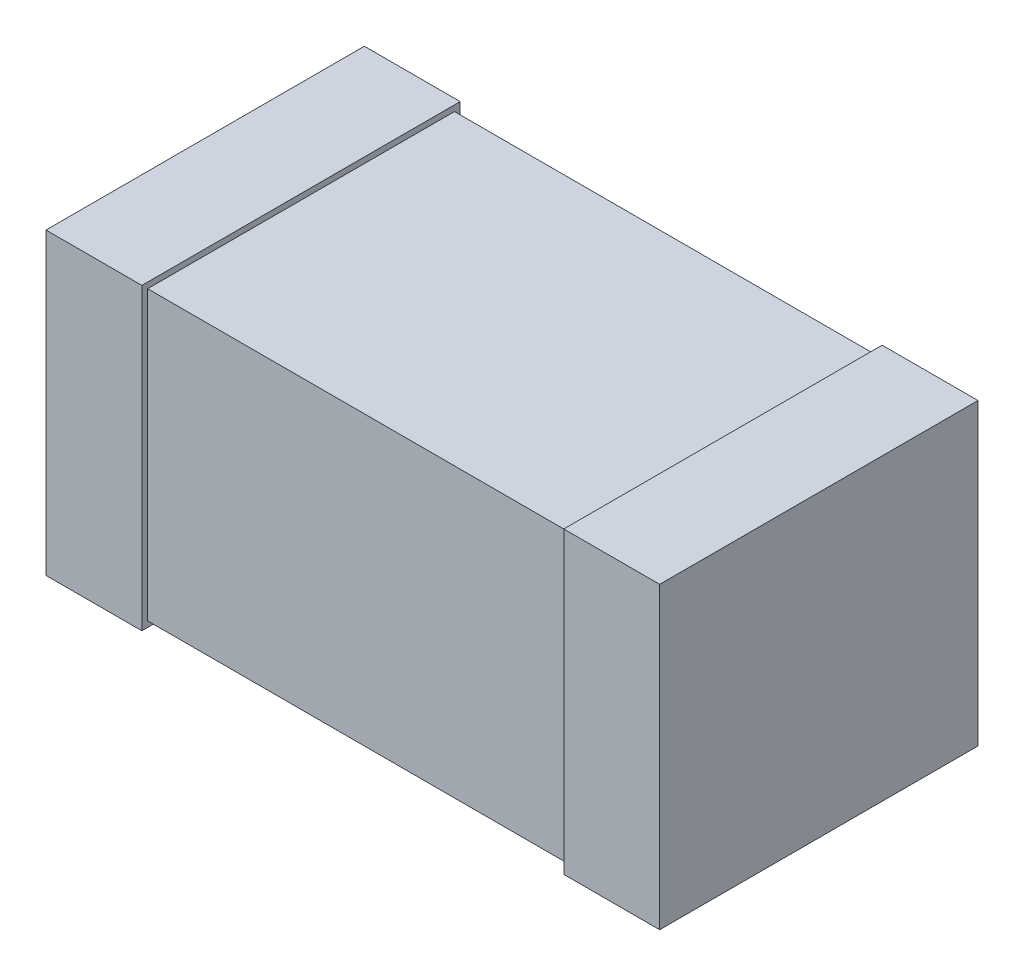
ISO-10303-21;
HEADER;
FILE_DESCRIPTION(('STEP AP214'),'2;1');
FILE_NAME('part.step','',(''),(''),'','','');
FILE_SCHEMA(('AUTOMOTIVE_DESIGN { 1 0 10303 214 1 1 1 1 }'));
ENDSEC;
DATA;
#1=APPLICATION_CONTEXT('core data for automotive mechanical design processes');
#2=APPLICATION_PROTOCOL_DEFINITION('international standard','automotive_design',2000,#1);
#3=PRODUCT_CONTEXT('',#1,'mechanical');
#4=PRODUCT('Part','Part','',(#3));
#5=PRODUCT_RELATED_PRODUCT_CATEGORY('part','',(#4));
#6=PRODUCT_DEFINITION_FORMATION('','',#4);
#7=PRODUCT_DEFINITION_CONTEXT('part definition',#1,'design');
#8=PRODUCT_DEFINITION('design','',#6,#7);
#9=PRODUCT_DEFINITION_SHAPE('','',#8);
#10=(LENGTH_UNIT() NAMED_UNIT(*) SI_UNIT(.MILLI.,.METRE.));
#11=(NAMED_UNIT(*) PLANE_ANGLE_UNIT() SI_UNIT($,.RADIAN.));
#12=(NAMED_UNIT(*) SI_UNIT($,.STERADIAN.) SOLID_ANGLE_UNIT());
#13=UNCERTAINTY_MEASURE_WITH_UNIT(LENGTH_MEASURE(1.E-05),#10,'distance_accuracy_value','');
#14=(GEOMETRIC_REPRESENTATION_CONTEXT(3) GLOBAL_UNCERTAINTY_ASSIGNED_CONTEXT((#13)) GLOBAL_UNIT_ASSIGNED_CONTEXT((#10,
#11,#12)) REPRESENTATION_CONTEXT('',''));
#15=CARTESIAN_POINT('',(0.,0.,0.));
#16=DIRECTION('',(0.,0.,1.));
#17=DIRECTION('',(1.,0.,0.));
#18=AXIS2_PLACEMENT_3D('',#15,#16,#17);
#19=CARTESIAN_POINT('',(-1.6,1.5,0.8));
#20=DIRECTION('',(0.,0.,-1.));
#21=DIRECTION('',(-1.,0.,0.));
#22=AXIS2_PLACEMENT_3D('',#19,#20,#21);
#23=PLANE('',#22);
#24=DIRECTION('',(0.,-1.,0.));
#25=VECTOR('',#24,1.);
#26=CARTESIAN_POINT('',(1.1,1.5,0.8));
#27=LINE('',#26,#25);
#28=CARTESIAN_POINT('',(1.1,1.5,0.8));
#29=VERTEX_POINT('',#28);
#30=CARTESIAN_POINT('',(1.1,0.,0.8));
#31=VERTEX_POINT('',#30);
#32=EDGE_CURVE('E33',#29,#31,#27,.T.);
#33=ORIENTED_EDGE('',*,*,#32,.F.);
#34=DIRECTION('',(1.,0.,0.));
#35=VECTOR('',#34,1.);
#36=CARTESIAN_POINT('',(-1.6,1.5,0.8));
#37=LINE('',#36,#35);
#38=CARTESIAN_POINT('',(-1.1,1.5,0.8));
#39=VERTEX_POINT('',#38);
#40=EDGE_CURVE('E198',#39,#29,#37,.T.);
#41=ORIENTED_EDGE('',*,*,#40,.F.);
#42=DIRECTION('',(0.,1.,0.));
#43=VECTOR('',#42,1.);
#44=CARTESIAN_POINT('',(-1.1,1.5,0.8));
#45=LINE('',#44,#43);
#46=CARTESIAN_POINT('',(-1.1,0.,0.8));
#47=VERTEX_POINT('',#46);
#48=EDGE_CURVE('E192',#47,#39,#45,.T.);
#49=ORIENTED_EDGE('',*,*,#48,.F.);
#50=DIRECTION('',(1.,0.,0.));
#51=VECTOR('',#50,1.);
#52=CARTESIAN_POINT('',(-1.6,0.,0.8));
#53=LINE('',#52,#51);
#54=EDGE_CURVE('E197',#47,#31,#53,.T.);
#55=ORIENTED_EDGE('',*,*,#54,.T.);
#56=EDGE_LOOP('',(#33,#41,#49,#55));
#57=FACE_BOUND('',#56,.T.);
#58=ADVANCED_FACE('F18',(#57),#23,.F.);
#59=CARTESIAN_POINT('',(-1.6,1.5,-0.8));
#60=DIRECTION('',(0.,0.,1.));
#61=DIRECTION('',(1.,0.,0.));
#62=AXIS2_PLACEMENT_3D('',#59,#60,#61);
#63=PLANE('',#62);
#64=DIRECTION('',(0.,1.,0.));
#65=VECTOR('',#64,1.);
#66=CARTESIAN_POINT('',(1.1,1.5,-0.8));
#67=LINE('',#66,#65);
#68=CARTESIAN_POINT('',(1.1,0.,-0.8));
#69=VERTEX_POINT('',#68);
#70=CARTESIAN_POINT('',(1.1,1.5,-0.8));
#71=VERTEX_POINT('',#70);
#72=EDGE_CURVE('E147',#69,#71,#67,.T.);
#73=ORIENTED_EDGE('',*,*,#72,.F.);
#74=DIRECTION('',(-1.,0.,0.));
#75=VECTOR('',#74,1.);
#76=CARTESIAN_POINT('',(-1.6,0.,-0.8));
#77=LINE('',#76,#75);
#78=CARTESIAN_POINT('',(-1.1,0.,-0.8));
#79=VERTEX_POINT('',#78);
#80=EDGE_CURVE('E201',#69,#79,#77,.T.);
#81=ORIENTED_EDGE('',*,*,#80,.T.);
#82=DIRECTION('',(0.,-1.,0.));
#83=VECTOR('',#82,1.);
#84=CARTESIAN_POINT('',(-1.1,1.5,-0.8));
#85=LINE('',#84,#83);
#86=CARTESIAN_POINT('',(-1.1,1.5,-0.8));
#87=VERTEX_POINT('',#86);
#88=EDGE_CURVE('E180',#87,#79,#85,.T.);
#89=ORIENTED_EDGE('',*,*,#88,.F.);
#90=DIRECTION('',(-1.,0.,0.));
#91=VECTOR('',#90,1.);
#92=CARTESIAN_POINT('',(-1.6,1.5,-0.8));
#93=LINE('',#92,#91);
#94=EDGE_CURVE('E200',#71,#87,#93,.T.);
#95=ORIENTED_EDGE('',*,*,#94,.F.);
#96=EDGE_LOOP('',(#73,#81,#89,#95));
#97=FACE_BOUND('',#96,.T.);
#98=ADVANCED_FACE('F218',(#97),#63,.F.);
#99=CARTESIAN_POINT('',(-1.6,1.5,0.8));
#100=DIRECTION('',(0.,1.,0.));
#101=DIRECTION('',(0.,0.,1.));
#102=AXIS2_PLACEMENT_3D('',#99,#100,#101);
#103=PLANE('',#102);
#104=ORIENTED_EDGE('',*,*,#40,.T.);
#105=DIRECTION('',(0.,0.,-1.));
#106=VECTOR('',#105,1.);
#107=CARTESIAN_POINT('',(1.1,1.5,0.8));
#108=LINE('',#107,#106);
#109=EDGE_CURVE('E40',#29,#71,#108,.T.);
#110=ORIENTED_EDGE('',*,*,#109,.T.);
#111=ORIENTED_EDGE('',*,*,#94,.T.);
#112=DIRECTION('',(0.,0.,1.));
#113=VECTOR('',#112,1.);
#114=CARTESIAN_POINT('',(-1.1,1.5,0.8));
#115=LINE('',#114,#113);
#116=EDGE_CURVE('E195',#87,#39,#115,.T.);
#117=ORIENTED_EDGE('',*,*,#116,.T.);
#118=EDGE_LOOP('',(#104,#110,#111,#117));
#119=FACE_BOUND('',#118,.T.);
#120=ADVANCED_FACE('F215',(#119),#103,.T.);
#121=CARTESIAN_POINT('',(-1.6,0.,0.8));
#122=DIRECTION('',(0.,1.,0.));
#123=DIRECTION('',(0.,0.,1.));
#124=AXIS2_PLACEMENT_3D('',#121,#122,#123);
#125=PLANE('',#124);
#126=DIRECTION('',(0.,0.,-1.));
#127=VECTOR('',#126,1.);
#128=CARTESIAN_POINT('',(1.1,0.,0.8));
#129=LINE('',#128,#127);
#130=EDGE_CURVE('E11',#31,#69,#129,.T.);
#131=ORIENTED_EDGE('',*,*,#130,.F.);
#132=ORIENTED_EDGE('',*,*,#54,.F.);
#133=DIRECTION('',(0.,0.,1.));
#134=VECTOR('',#133,1.);
#135=CARTESIAN_POINT('',(-1.1,0.,0.8));
#136=LINE('',#135,#134);
#137=EDGE_CURVE('E26',#79,#47,#136,.T.);
#138=ORIENTED_EDGE('',*,*,#137,.F.);
#139=ORIENTED_EDGE('',*,*,#80,.F.);
#140=EDGE_LOOP('',(#131,#132,#138,#139));
#141=FACE_BOUND('',#140,.T.);
#142=ADVANCED_FACE('F213',(#141),#125,.F.);
#143=CARTESIAN_POINT('',(-1.1,-0.03,2.49816971037802));
#144=DIRECTION('',(0.,1.,0.));
#145=DIRECTION('',(-1.,0.,0.));
#146=AXIS2_PLACEMENT_3D('',#143,#144,#145);
#147=PLANE('',#146);
#148=DIRECTION('',(0.,0.,-1.));
#149=VECTOR('',#148,1.);
#150=CARTESIAN_POINT('',(-1.1,-0.03,2.49816971037802));
#151=LINE('',#150,#149);
#152=CARTESIAN_POINT('',(-1.1,-0.03,0.83));
#153=VERTEX_POINT('',#152);
#154=CARTESIAN_POINT('',(-1.1,-0.03,-0.83));
#155=VERTEX_POINT('',#154);
#156=EDGE_CURVE('E169',#153,#155,#151,.T.);
#157=ORIENTED_EDGE('',*,*,#156,.F.);
#158=DIRECTION('',(-1.,0.,0.));
#159=VECTOR('',#158,1.);
#160=CARTESIAN_POINT('',(-1.1,-0.03,0.83));
#161=LINE('',#160,#159);
#162=CARTESIAN_POINT('',(-1.6,-0.0300000000000001,0.83));
#163=VERTEX_POINT('',#162);
#164=EDGE_CURVE('E174',#153,#163,#161,.T.);
#165=ORIENTED_EDGE('',*,*,#164,.T.);
#166=DIRECTION('',(0.,0.,-1.));
#167=VECTOR('',#166,1.);
#168=CARTESIAN_POINT('',(-1.6,-0.0300000000000001,2.49816971037802));
#169=LINE('',#168,#167);
#170=CARTESIAN_POINT('',(-1.6,-0.0300000000000001,-0.83));
#171=VERTEX_POINT('',#170);
#172=EDGE_CURVE('E182',#163,#171,#169,.T.);
#173=ORIENTED_EDGE('',*,*,#172,.T.);
#174=DIRECTION('',(-1.,0.,0.));
#175=VECTOR('',#174,1.);
#176=CARTESIAN_POINT('',(-1.1,-0.03,-0.83));
#177=LINE('',#176,#175);
#178=EDGE_CURVE('E160',#155,#171,#177,.T.);
#179=ORIENTED_EDGE('',*,*,#178,.F.);
#180=EDGE_LOOP('',(#157,#165,#173,#179));
#181=FACE_BOUND('',#180,.T.);
#182=ADVANCED_FACE('F260',(#181),#147,.F.);
#183=CARTESIAN_POINT('',(-1.1,1.53,2.49816971037802));
#184=DIRECTION('',(0.,-1.,0.));
#185=DIRECTION('',(0.,0.,-1.));
#186=AXIS2_PLACEMENT_3D('',#183,#184,#185);
#187=PLANE('',#186);
#188=DIRECTION('',(0.,0.,-1.));
#189=VECTOR('',#188,1.);
#190=CARTESIAN_POINT('',(-1.6,1.53,2.49816971037802));
#191=LINE('',#190,#189);
#192=CARTESIAN_POINT('',(-1.6,1.53,0.83));
#193=VERTEX_POINT('',#192);
#194=CARTESIAN_POINT('',(-1.6,1.53,-0.83));
#195=VERTEX_POINT('',#194);
#196=EDGE_CURVE('E184',#193,#195,#191,.T.);
#197=ORIENTED_EDGE('',*,*,#196,.F.);
#198=DIRECTION('',(1.,0.,0.));
#199=VECTOR('',#198,1.);
#200=CARTESIAN_POINT('',(-1.1,1.53,0.83));
#201=LINE('',#200,#199);
#202=CARTESIAN_POINT('',(-1.1,1.53,0.83));
#203=VERTEX_POINT('',#202);
#204=EDGE_CURVE('E173',#193,#203,#201,.T.);
#205=ORIENTED_EDGE('',*,*,#204,.T.);
#206=DIRECTION('',(0.,0.,-1.));
#207=VECTOR('',#206,1.);
#208=CARTESIAN_POINT('',(-1.1,1.53,2.49816971037802));
#209=LINE('',#208,#207);
#210=CARTESIAN_POINT('',(-1.1,1.53,-0.83));
#211=VERTEX_POINT('',#210);
#212=EDGE_CURVE('E186',#203,#211,#209,.T.);
#213=ORIENTED_EDGE('',*,*,#212,.T.);
#214=DIRECTION('',(1.,0.,0.));
#215=VECTOR('',#214,1.);
#216=CARTESIAN_POINT('',(-1.1,1.53,-0.83));
#217=LINE('',#216,#215);
#218=EDGE_CURVE('E166',#195,#211,#217,.T.);
#219=ORIENTED_EDGE('',*,*,#218,.F.);
#220=EDGE_LOOP('',(#197,#205,#213,#219));
#221=FACE_BOUND('',#220,.T.);
#222=ADVANCED_FACE('F263',(#221),#187,.F.);
#223=CARTESIAN_POINT('',(-1.1,1.53,2.49816971037802));
#224=DIRECTION('',(-1.,0.,0.));
#225=DIRECTION('',(0.,-1.,0.));
#226=AXIS2_PLACEMENT_3D('',#223,#224,#225);
#227=PLANE('',#226);
#228=ORIENTED_EDGE('',*,*,#116,.F.);
#229=ORIENTED_EDGE('',*,*,#88,.T.);
#230=ORIENTED_EDGE('',*,*,#137,.T.);
#231=ORIENTED_EDGE('',*,*,#48,.T.);
#232=EDGE_LOOP('',(#228,#229,#230,#231));
#233=FACE_BOUND('',#232,.T.);
#234=ORIENTED_EDGE('',*,*,#212,.F.);
#235=DIRECTION('',(0.,-1.,0.));
#236=VECTOR('',#235,1.);
#237=CARTESIAN_POINT('',(-1.1,1.53,0.83));
#238=LINE('',#237,#236);
#239=EDGE_CURVE('E177',#203,#153,#238,.T.);
#240=ORIENTED_EDGE('',*,*,#239,.T.);
#241=ORIENTED_EDGE('',*,*,#156,.T.);
#242=DIRECTION('',(0.,-1.,0.));
#243=VECTOR('',#242,1.);
#244=CARTESIAN_POINT('',(-1.1,1.53,-0.83));
#245=LINE('',#244,#243);
#246=EDGE_CURVE('E163',#211,#155,#245,.T.);
#247=ORIENTED_EDGE('',*,*,#246,.F.);
#248=EDGE_LOOP('',(#234,#240,#241,#247));
#249=FACE_BOUND('',#248,.T.);
#250=ADVANCED_FACE('F208',(#233,#249),#227,.F.);
#251=CARTESIAN_POINT('',(-1.6,1.5,0.83));
#252=DIRECTION('',(0.,0.,-1.));
#253=DIRECTION('',(-1.,0.,0.));
#254=AXIS2_PLACEMENT_3D('',#251,#252,#253);
#255=PLANE('',#254);
#256=ORIENTED_EDGE('',*,*,#204,.F.);
#257=DIRECTION('',(0.,1.,0.));
#258=VECTOR('',#257,1.);
#259=CARTESIAN_POINT('',(-1.6,1.53,0.83));
#260=LINE('',#259,#258);
#261=EDGE_CURVE('E170',#163,#193,#260,.T.);
#262=ORIENTED_EDGE('',*,*,#261,.F.);
#263=ORIENTED_EDGE('',*,*,#164,.F.);
#264=ORIENTED_EDGE('',*,*,#239,.F.);
#265=EDGE_LOOP('',(#256,#262,#263,#264));
#266=FACE_BOUND('',#265,.T.);
#267=ADVANCED_FACE('F255',(#266),#255,.F.);
#268=CARTESIAN_POINT('',(-1.6,1.5,-0.83));
#269=DIRECTION('',(0.,0.,1.));
#270=DIRECTION('',(1.,0.,0.));
#271=AXIS2_PLACEMENT_3D('',#268,#269,#270);
#272=PLANE('',#271);
#273=ORIENTED_EDGE('',*,*,#246,.T.);
#274=ORIENTED_EDGE('',*,*,#178,.T.);
#275=DIRECTION('',(0.,1.,0.));
#276=VECTOR('',#275,1.);
#277=CARTESIAN_POINT('',(-1.6,1.53,-0.83));
#278=LINE('',#277,#276);
#279=EDGE_CURVE('E157',#171,#195,#278,.T.);
#280=ORIENTED_EDGE('',*,*,#279,.T.);
#281=ORIENTED_EDGE('',*,*,#218,.T.);
#282=EDGE_LOOP('',(#273,#274,#280,#281));
#283=FACE_BOUND('',#282,.T.);
#284=ADVANCED_FACE('F252',(#283),#272,.F.);
#285=CARTESIAN_POINT('',(-1.6,1.5,-0.8));
#286=DIRECTION('',(1.,0.,0.));
#287=DIRECTION('',(0.,0.,-1.));
#288=AXIS2_PLACEMENT_3D('',#285,#286,#287);
#289=PLANE('',#288);
#290=ORIENTED_EDGE('',*,*,#172,.F.);
#291=ORIENTED_EDGE('',*,*,#261,.T.);
#292=ORIENTED_EDGE('',*,*,#196,.T.);
#293=ORIENTED_EDGE('',*,*,#279,.F.);
#294=EDGE_LOOP('',(#290,#291,#292,#293));
#295=FACE_BOUND('',#294,.T.);
#296=ADVANCED_FACE('F20',(#295),#289,.F.);
#297=CARTESIAN_POINT('',(1.1,-0.0299999999999997,2.49816971037802));
#298=DIRECTION('',(0.,1.,0.));
#299=DIRECTION('',(-1.,0.,0.));
#300=AXIS2_PLACEMENT_3D('',#297,#298,#299);
#301=PLANE('',#300);
#302=DIRECTION('',(0.,0.,-1.));
#303=VECTOR('',#302,1.);
#304=CARTESIAN_POINT('',(1.6,-0.0299999999999997,2.49816971037802));
#305=LINE('',#304,#303);
#306=CARTESIAN_POINT('',(1.6,-0.0299999999999997,0.83));
#307=VERTEX_POINT('',#306);
#308=CARTESIAN_POINT('',(1.6,-0.0299999999999997,-0.83));
#309=VERTEX_POINT('',#308);
#310=EDGE_CURVE('E120',#307,#309,#305,.T.);
#311=ORIENTED_EDGE('',*,*,#310,.F.);
#312=DIRECTION('',(-1.,0.,0.));
#313=VECTOR('',#312,1.);
#314=CARTESIAN_POINT('',(1.1,-0.0299999999999997,0.83));
#315=LINE('',#314,#313);
#316=CARTESIAN_POINT('',(1.1,-0.0299999999999997,0.83));
#317=VERTEX_POINT('',#316);
#318=EDGE_CURVE('E115',#307,#317,#315,.T.);
#319=ORIENTED_EDGE('',*,*,#318,.T.);
#320=DIRECTION('',(0.,0.,-1.));
#321=VECTOR('',#320,1.);
#322=CARTESIAN_POINT('',(1.1,-0.0299999999999997,2.49816971037802));
#323=LINE('',#322,#321);
#324=CARTESIAN_POINT('',(1.1,-0.0299999999999997,-0.83));
#325=VERTEX_POINT('',#324);
#326=EDGE_CURVE('E110',#317,#325,#323,.T.);
#327=ORIENTED_EDGE('',*,*,#326,.T.);
#328=DIRECTION('',(-1.,0.,0.));
#329=VECTOR('',#328,1.);
#330=CARTESIAN_POINT('',(1.1,-0.0299999999999997,-0.83));
#331=LINE('',#330,#329);
#332=EDGE_CURVE('E114',#309,#325,#331,.T.);
#333=ORIENTED_EDGE('',*,*,#332,.F.);
#334=EDGE_LOOP('',(#311,#319,#327,#333));
#335=FACE_BOUND('',#334,.T.);
#336=ADVANCED_FACE('F113',(#335),#301,.F.);
#337=CARTESIAN_POINT('',(1.1,1.53,2.49816971037802));
#338=DIRECTION('',(1.,0.,0.));
#339=DIRECTION('',(0.,1.,0.));
#340=AXIS2_PLACEMENT_3D('',#337,#338,#339);
#341=PLANE('',#340);
#342=ORIENTED_EDGE('',*,*,#109,.F.);
#343=ORIENTED_EDGE('',*,*,#32,.T.);
#344=ORIENTED_EDGE('',*,*,#130,.T.);
#345=ORIENTED_EDGE('',*,*,#72,.T.);
#346=EDGE_LOOP('',(#342,#343,#344,#345));
#347=FACE_BOUND('',#346,.T.);
#348=ORIENTED_EDGE('',*,*,#326,.F.);
#349=DIRECTION('',(0.,1.,0.));
#350=VECTOR('',#349,1.);
#351=CARTESIAN_POINT('',(1.1,1.53,0.83));
#352=LINE('',#351,#350);
#353=CARTESIAN_POINT('',(1.1,1.53,0.83));
#354=VERTEX_POINT('',#353);
#355=EDGE_CURVE('E142',#317,#354,#352,.T.);
#356=ORIENTED_EDGE('',*,*,#355,.T.);
#357=DIRECTION('',(0.,0.,-1.));
#358=VECTOR('',#357,1.);
#359=CARTESIAN_POINT('',(1.1,1.53,2.49816971037802));
#360=LINE('',#359,#358);
#361=CARTESIAN_POINT('',(1.1,1.53,-0.83));
#362=VERTEX_POINT('',#361);
#363=EDGE_CURVE('E119',#354,#362,#360,.T.);
#364=ORIENTED_EDGE('',*,*,#363,.T.);
#365=DIRECTION('',(0.,1.,0.));
#366=VECTOR('',#365,1.);
#367=CARTESIAN_POINT('',(1.1,1.53,-0.83));
#368=LINE('',#367,#366);
#369=EDGE_CURVE('E127',#325,#362,#368,.T.);
#370=ORIENTED_EDGE('',*,*,#369,.F.);
#371=EDGE_LOOP('',(#348,#356,#364,#370));
#372=FACE_BOUND('',#371,.T.);
#373=ADVANCED_FACE('F132',(#347,#372),#341,.F.);
#374=CARTESIAN_POINT('',(1.1,1.53,2.49816971037802));
#375=DIRECTION('',(0.,-1.,0.));
#376=DIRECTION('',(1.,0.,0.));
#377=AXIS2_PLACEMENT_3D('',#374,#375,#376);
#378=PLANE('',#377);
#379=ORIENTED_EDGE('',*,*,#363,.F.);
#380=DIRECTION('',(1.,0.,0.));
#381=VECTOR('',#380,1.);
#382=CARTESIAN_POINT('',(1.1,1.53,0.83));
#383=LINE('',#382,#381);
#384=CARTESIAN_POINT('',(1.6,1.53,0.83));
#385=VERTEX_POINT('',#384);
#386=EDGE_CURVE('E145',#354,#385,#383,.T.);
#387=ORIENTED_EDGE('',*,*,#386,.T.);
#388=DIRECTION('',(0.,0.,-1.));
#389=VECTOR('',#388,1.);
#390=CARTESIAN_POINT('',(1.6,1.53,2.49816971037802));
#391=LINE('',#390,#389);
#392=CARTESIAN_POINT('',(1.6,1.53,-0.83));
#393=VERTEX_POINT('',#392);
#394=EDGE_CURVE('E134',#385,#393,#391,.T.);
#395=ORIENTED_EDGE('',*,*,#394,.T.);
#396=DIRECTION('',(1.,0.,0.));
#397=VECTOR('',#396,1.);
#398=CARTESIAN_POINT('',(1.1,1.53,-0.83));
#399=LINE('',#398,#397);
#400=EDGE_CURVE('E135',#362,#393,#399,.T.);
#401=ORIENTED_EDGE('',*,*,#400,.F.);
#402=EDGE_LOOP('',(#379,#387,#395,#401));
#403=FACE_BOUND('',#402,.T.);
#404=ADVANCED_FACE('F239',(#403),#378,.F.);
#405=CARTESIAN_POINT('',(-1.6,1.5,0.83));
#406=DIRECTION('',(0.,0.,-1.));
#407=DIRECTION('',(-1.,0.,0.));
#408=AXIS2_PLACEMENT_3D('',#405,#406,#407);
#409=PLANE('',#408);
#410=ORIENTED_EDGE('',*,*,#355,.F.);
#411=ORIENTED_EDGE('',*,*,#318,.F.);
#412=DIRECTION('',(0.,-1.,0.));
#413=VECTOR('',#412,1.);
#414=CARTESIAN_POINT('',(1.6,1.53,0.83));
#415=LINE('',#414,#413);
#416=EDGE_CURVE('E143',#385,#307,#415,.T.);
#417=ORIENTED_EDGE('',*,*,#416,.F.);
#418=ORIENTED_EDGE('',*,*,#386,.F.);
#419=EDGE_LOOP('',(#410,#411,#417,#418));
#420=FACE_BOUND('',#419,.T.);
#421=ADVANCED_FACE('F235',(#420),#409,.F.);
#422=CARTESIAN_POINT('',(-1.6,1.5,-0.83));
#423=DIRECTION('',(0.,0.,1.));
#424=DIRECTION('',(1.,0.,0.));
#425=AXIS2_PLACEMENT_3D('',#422,#423,#424);
#426=PLANE('',#425);
#427=ORIENTED_EDGE('',*,*,#400,.T.);
#428=DIRECTION('',(0.,-1.,0.));
#429=VECTOR('',#428,1.);
#430=CARTESIAN_POINT('',(1.6,1.53,-0.83));
#431=LINE('',#430,#429);
#432=EDGE_CURVE('E130',#393,#309,#431,.T.);
#433=ORIENTED_EDGE('',*,*,#432,.T.);
#434=ORIENTED_EDGE('',*,*,#332,.T.);
#435=ORIENTED_EDGE('',*,*,#369,.T.);
#436=EDGE_LOOP('',(#427,#433,#434,#435));
#437=FACE_BOUND('',#436,.T.);
#438=ADVANCED_FACE('F126',(#437),#426,.F.);
#439=CARTESIAN_POINT('',(1.6,1.5,-0.8));
#440=DIRECTION('',(-1.,0.,0.));
#441=DIRECTION('',(0.,0.,1.));
#442=AXIS2_PLACEMENT_3D('',#439,#440,#441);
#443=PLANE('',#442);
#444=ORIENTED_EDGE('',*,*,#394,.F.);
#445=ORIENTED_EDGE('',*,*,#416,.T.);
#446=ORIENTED_EDGE('',*,*,#310,.T.);
#447=ORIENTED_EDGE('',*,*,#432,.F.);
#448=EDGE_LOOP('',(#444,#445,#446,#447));
#449=FACE_BOUND('',#448,.T.);
#450=ADVANCED_FACE('F229',(#449),#443,.F.);
#451=CLOSED_SHELL('',(#58,#98,#120,#142,#182,#222,#250,#267,#284,#296,#336,#373,#404,#421,#438,#450));
#452=MANIFOLD_SOLID_BREP('B1',#451);
#453=ADVANCED_BREP_SHAPE_REPRESENTATION('',(#18,#452),#14);
#454=SHAPE_DEFINITION_REPRESENTATION(#9,#453);
ENDSEC;
END-ISO-10303-21;
